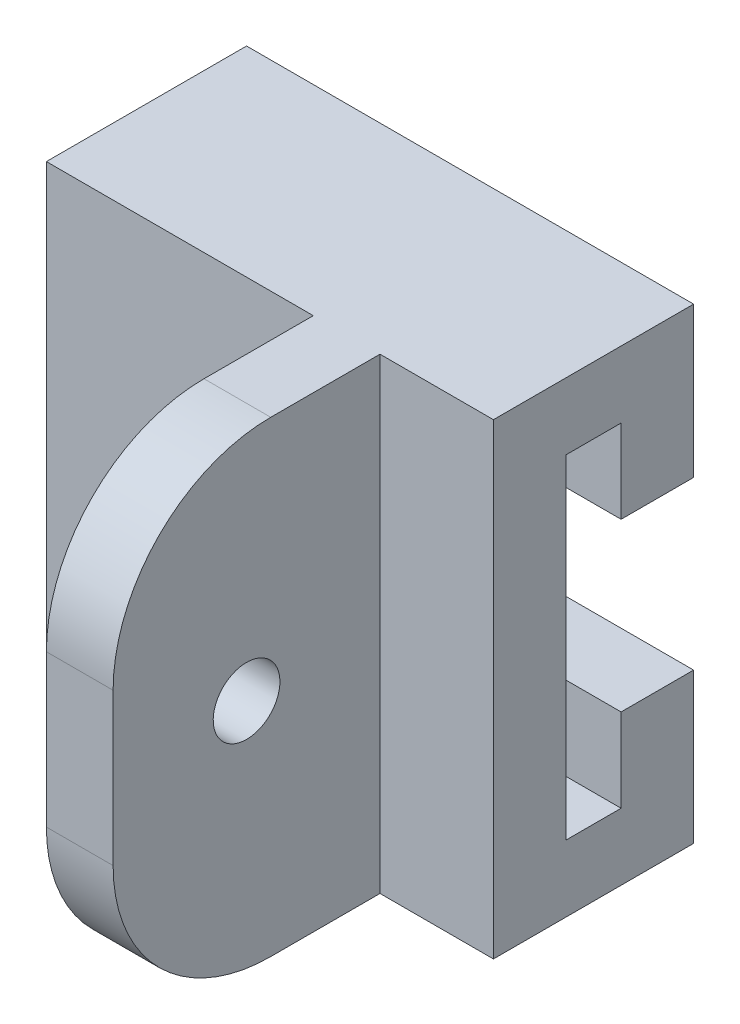
ISO-10303-21;
HEADER;
FILE_DESCRIPTION(('STEP AP214'),'2;1');
FILE_NAME('part.step','',(''),(''),'','','');
FILE_SCHEMA(('AUTOMOTIVE_DESIGN { 1 0 10303 214 1 1 1 1 }'));
ENDSEC;
DATA;
#1=APPLICATION_CONTEXT('core data for automotive mechanical design processes');
#2=APPLICATION_PROTOCOL_DEFINITION('international standard','automotive_design',2000,#1);
#3=PRODUCT_CONTEXT('',#1,'mechanical');
#4=PRODUCT('Part','Part','',(#3));
#5=PRODUCT_RELATED_PRODUCT_CATEGORY('part','',(#4));
#6=PRODUCT_DEFINITION_FORMATION('','',#4);
#7=PRODUCT_DEFINITION_CONTEXT('part definition',#1,'design');
#8=PRODUCT_DEFINITION('design','',#6,#7);
#9=PRODUCT_DEFINITION_SHAPE('','',#8);
#10=(LENGTH_UNIT() NAMED_UNIT(*) SI_UNIT(.MILLI.,.METRE.));
#11=(NAMED_UNIT(*) PLANE_ANGLE_UNIT() SI_UNIT($,.RADIAN.));
#12=(NAMED_UNIT(*) SI_UNIT($,.STERADIAN.) SOLID_ANGLE_UNIT());
#13=UNCERTAINTY_MEASURE_WITH_UNIT(LENGTH_MEASURE(1.E-05),#10,'distance_accuracy_value','');
#14=(GEOMETRIC_REPRESENTATION_CONTEXT(3) GLOBAL_UNCERTAINTY_ASSIGNED_CONTEXT((#13)) GLOBAL_UNIT_ASSIGNED_CONTEXT((#10,
#11,#12)) REPRESENTATION_CONTEXT('',''));
#15=CARTESIAN_POINT('',(0.,0.,0.));
#16=DIRECTION('',(0.,0.,1.));
#17=DIRECTION('',(1.,0.,0.));
#18=AXIS2_PLACEMENT_3D('',#15,#16,#17);
#19=CARTESIAN_POINT('',(0.,0.,19.05));
#20=DIRECTION('',(0.,0.,1.));
#21=DIRECTION('',(1.,0.,0.));
#22=AXIS2_PLACEMENT_3D('',#19,#20,#21);
#23=PLANE('',#22);
#24=DIRECTION('',(0.,1.,0.));
#25=VECTOR('',#24,1.);
#26=CARTESIAN_POINT('',(10.4775,22.225,19.05));
#27=LINE('',#26,#25);
#28=CARTESIAN_POINT('',(10.4775,-22.225,19.05));
#29=VERTEX_POINT('',#28);
#30=CARTESIAN_POINT('',(10.4775,22.225,19.05));
#31=VERTEX_POINT('',#30);
#32=EDGE_CURVE('E191',#29,#31,#27,.T.);
#33=ORIENTED_EDGE('',*,*,#32,.F.);
#34=DIRECTION('',(1.,0.,0.));
#35=VECTOR('',#34,1.);
#36=CARTESIAN_POINT('',(21.2725,-22.225,19.05));
#37=LINE('',#36,#35);
#38=CARTESIAN_POINT('',(21.2725,-22.225,19.05));
#39=VERTEX_POINT('',#38);
#40=EDGE_CURVE('E186',#29,#39,#37,.T.);
#41=ORIENTED_EDGE('',*,*,#40,.T.);
#42=DIRECTION('',(0.,1.,0.));
#43=VECTOR('',#42,1.);
#44=CARTESIAN_POINT('',(21.2725,-22.225,19.05));
#45=LINE('',#44,#43);
#46=CARTESIAN_POINT('',(21.2725,22.225,19.05));
#47=VERTEX_POINT('',#46);
#48=EDGE_CURVE('E185',#39,#47,#45,.T.);
#49=ORIENTED_EDGE('',*,*,#48,.T.);
#50=DIRECTION('',(-1.,0.,0.));
#51=VECTOR('',#50,1.);
#52=CARTESIAN_POINT('',(21.2725,22.225,19.05));
#53=LINE('',#52,#51);
#54=EDGE_CURVE('E274',#47,#31,#53,.T.);
#55=ORIENTED_EDGE('',*,*,#54,.T.);
#56=EDGE_LOOP('',(#33,#41,#49,#55));
#57=FACE_BOUND('',#56,.T.);
#58=ADVANCED_FACE('F41',(#57),#23,.T.);
#59=CARTESIAN_POINT('',(0.,0.,0.));
#60=DIRECTION('',(0.,0.,1.));
#61=DIRECTION('',(1.,0.,0.));
#62=AXIS2_PLACEMENT_3D('',#59,#60,#61);
#63=PLANE('',#62);
#64=DIRECTION('',(0.,1.,0.));
#65=VECTOR('',#64,1.);
#66=CARTESIAN_POINT('',(21.2725,-22.225,0.));
#67=LINE('',#66,#65);
#68=CARTESIAN_POINT('',(21.2725,7.9375,0.));
#69=VERTEX_POINT('',#68);
#70=CARTESIAN_POINT('',(21.2725,22.225,0.));
#71=VERTEX_POINT('',#70);
#72=EDGE_CURVE('E286',#69,#71,#67,.T.);
#73=ORIENTED_EDGE('',*,*,#72,.F.);
#74=DIRECTION('',(1.,0.,0.));
#75=VECTOR('',#74,1.);
#76=CARTESIAN_POINT('',(21.2725,7.9375,0.));
#77=LINE('',#76,#75);
#78=CARTESIAN_POINT('',(-21.2725,7.9375,0.));
#79=VERTEX_POINT('',#78);
#80=EDGE_CURVE('E214',#79,#69,#77,.T.);
#81=ORIENTED_EDGE('',*,*,#80,.F.);
#82=DIRECTION('',(0.,-1.,0.));
#83=VECTOR('',#82,1.);
#84=CARTESIAN_POINT('',(-21.2725,-22.225,0.));
#85=LINE('',#84,#83);
#86=CARTESIAN_POINT('',(-21.2725,22.225,0.));
#87=VERTEX_POINT('',#86);
#88=EDGE_CURVE('E279',#87,#79,#85,.T.);
#89=ORIENTED_EDGE('',*,*,#88,.F.);
#90=DIRECTION('',(-1.,0.,0.));
#91=VECTOR('',#90,1.);
#92=CARTESIAN_POINT('',(21.2725,22.225,0.));
#93=LINE('',#92,#91);
#94=EDGE_CURVE('E269',#71,#87,#93,.T.);
#95=ORIENTED_EDGE('',*,*,#94,.F.);
#96=EDGE_LOOP('',(#73,#81,#89,#95));
#97=FACE_BOUND('',#96,.T.);
#98=ADVANCED_FACE('F408',(#97),#63,.F.);
#99=CARTESIAN_POINT('',(21.2725,-15.875,6.9));
#100=DIRECTION('',(0.,0.,-1.));
#101=DIRECTION('',(-1.,0.,0.));
#102=AXIS2_PLACEMENT_3D('',#99,#100,#101);
#103=PLANE('',#102);
#104=DIRECTION('',(0.,-1.,0.));
#105=VECTOR('',#104,1.);
#106=CARTESIAN_POINT('',(-21.2725,-15.875,6.9));
#107=LINE('',#106,#105);
#108=CARTESIAN_POINT('',(-21.2725,15.875,6.9));
#109=VERTEX_POINT('',#108);
#110=CARTESIAN_POINT('',(-21.2725,7.9375,6.9));
#111=VERTEX_POINT('',#110);
#112=EDGE_CURVE('E255',#109,#111,#107,.T.);
#113=ORIENTED_EDGE('',*,*,#112,.T.);
#114=DIRECTION('',(-1.,0.,0.));
#115=VECTOR('',#114,1.);
#116=CARTESIAN_POINT('',(21.2725,7.9375,6.9));
#117=LINE('',#116,#115);
#118=CARTESIAN_POINT('',(21.2725,7.9375,6.9));
#119=VERTEX_POINT('',#118);
#120=EDGE_CURVE('E211',#119,#111,#117,.T.);
#121=ORIENTED_EDGE('',*,*,#120,.F.);
#122=DIRECTION('',(0.,-1.,0.));
#123=VECTOR('',#122,1.);
#124=CARTESIAN_POINT('',(21.2725,-15.875,6.9));
#125=LINE('',#124,#123);
#126=CARTESIAN_POINT('',(21.2725,15.875,6.9));
#127=VERTEX_POINT('',#126);
#128=EDGE_CURVE('E243',#127,#119,#125,.T.);
#129=ORIENTED_EDGE('',*,*,#128,.F.);
#130=DIRECTION('',(-1.,0.,0.));
#131=VECTOR('',#130,1.);
#132=CARTESIAN_POINT('',(21.2725,15.875,6.9));
#133=LINE('',#132,#131);
#134=EDGE_CURVE('E250',#127,#109,#133,.T.);
#135=ORIENTED_EDGE('',*,*,#134,.T.);
#136=EDGE_LOOP('',(#113,#121,#129,#135));
#137=FACE_BOUND('',#136,.T.);
#138=ADVANCED_FACE('F414',(#137),#103,.F.);
#139=CARTESIAN_POINT('',(-21.2725,-22.225,19.05));
#140=DIRECTION('',(1.,0.,0.));
#141=DIRECTION('',(0.,0.,-1.));
#142=AXIS2_PLACEMENT_3D('',#139,#140,#141);
#143=PLANE('',#142);
#144=DIRECTION('',(0.,0.,-1.));
#145=VECTOR('',#144,1.);
#146=CARTESIAN_POINT('',(-21.2725,15.875,6.9));
#147=LINE('',#146,#145);
#148=CARTESIAN_POINT('',(-21.2725,15.875,13.6500000000003));
#149=VERTEX_POINT('',#148);
#150=EDGE_CURVE('E236',#149,#109,#147,.T.);
#151=ORIENTED_EDGE('',*,*,#150,.F.);
#152=DIRECTION('',(0.,-1.,0.));
#153=VECTOR('',#152,1.);
#154=CARTESIAN_POINT('',(-21.2725,-22.225,13.6500000000003));
#155=LINE('',#154,#153);
#156=CARTESIAN_POINT('',(-21.2725,-15.875,13.6500000000003));
#157=VERTEX_POINT('',#156);
#158=EDGE_CURVE('E311',#149,#157,#155,.T.);
#159=ORIENTED_EDGE('',*,*,#158,.T.);
#160=DIRECTION('',(0.,0.,1.));
#161=VECTOR('',#160,1.);
#162=CARTESIAN_POINT('',(-21.2725,-15.875,6.9));
#163=LINE('',#162,#161);
#164=CARTESIAN_POINT('',(-21.2725,-15.875,6.9));
#165=VERTEX_POINT('',#164);
#166=EDGE_CURVE('E242',#165,#157,#163,.T.);
#167=ORIENTED_EDGE('',*,*,#166,.F.);
#168=CARTESIAN_POINT('',(-21.2725,-7.9375,6.9));
#169=VERTEX_POINT('',#168);
#170=EDGE_CURVE('E254',#169,#165,#107,.T.);
#171=ORIENTED_EDGE('',*,*,#170,.F.);
#172=DIRECTION('',(0.,0.,-1.));
#173=VECTOR('',#172,1.);
#174=CARTESIAN_POINT('',(-21.2725,-7.9375,19.051));
#175=LINE('',#174,#173);
#176=CARTESIAN_POINT('',(-21.2725,-7.9375,0.));
#177=VERTEX_POINT('',#176);
#178=EDGE_CURVE('E223',#169,#177,#175,.T.);
#179=ORIENTED_EDGE('',*,*,#178,.T.);
#180=CARTESIAN_POINT('',(-21.2725,-22.225,0.));
#181=VERTEX_POINT('',#180);
#182=EDGE_CURVE('E265',#177,#181,#85,.T.);
#183=ORIENTED_EDGE('',*,*,#182,.T.);
#184=DIRECTION('',(0.,0.,-1.));
#185=VECTOR('',#184,1.);
#186=CARTESIAN_POINT('',(-21.2725,-22.225,19.05));
#187=LINE('',#186,#185);
#188=CARTESIAN_POINT('',(-21.2725,-22.225,19.05));
#189=VERTEX_POINT('',#188);
#190=EDGE_CURVE('E304',#189,#181,#187,.T.);
#191=ORIENTED_EDGE('',*,*,#190,.F.);
#192=DIRECTION('',(0.,-1.,0.));
#193=VECTOR('',#192,1.);
#194=CARTESIAN_POINT('',(-21.2725,-22.225,19.05));
#195=LINE('',#194,#193);
#196=CARTESIAN_POINT('',(-21.2725,22.225,19.05));
#197=VERTEX_POINT('',#196);
#198=EDGE_CURVE('E182',#197,#189,#195,.T.);
#199=ORIENTED_EDGE('',*,*,#198,.F.);
#200=DIRECTION('',(0.,0.,-1.));
#201=VECTOR('',#200,1.);
#202=CARTESIAN_POINT('',(-21.2725,22.225,19.05));
#203=LINE('',#202,#201);
#204=EDGE_CURVE('E278',#197,#87,#203,.T.);
#205=ORIENTED_EDGE('',*,*,#204,.T.);
#206=ORIENTED_EDGE('',*,*,#88,.T.);
#207=DIRECTION('',(0.,0.,-1.));
#208=VECTOR('',#207,1.);
#209=CARTESIAN_POINT('',(-21.2725,7.9375,19.051));
#210=LINE('',#209,#208);
#211=EDGE_CURVE('E227',#111,#79,#210,.T.);
#212=ORIENTED_EDGE('',*,*,#211,.F.);
#213=ORIENTED_EDGE('',*,*,#112,.F.);
#214=EDGE_LOOP('',(#151,#159,#167,#171,#179,#183,#191,#199,#205,#206,#212,#213));
#215=FACE_BOUND('',#214,.T.);
#216=ADVANCED_FACE('F374',(#215),#143,.F.);
#217=CARTESIAN_POINT('',(21.2725,-22.225,19.05));
#218=DIRECTION('',(0.,1.,0.));
#219=DIRECTION('',(-1.,0.,0.));
#220=AXIS2_PLACEMENT_3D('',#217,#218,#219);
#221=PLANE('',#220);
#222=DIRECTION('',(0.,0.,-1.));
#223=VECTOR('',#222,1.);
#224=CARTESIAN_POINT('',(10.4775,-22.225,44.45));
#225=LINE('',#224,#223);
#226=CARTESIAN_POINT('',(10.4775,-22.225,29.45));
#227=VERTEX_POINT('',#226);
#228=EDGE_CURVE('E174',#227,#29,#225,.T.);
#229=ORIENTED_EDGE('',*,*,#228,.F.);
#230=DIRECTION('',(1.,0.,0.));
#231=VECTOR('',#230,1.);
#232=CARTESIAN_POINT('',(21.2725,-22.225,29.45));
#233=LINE('',#232,#231);
#234=CARTESIAN_POINT('',(4.1275,-22.225,29.45));
#235=VERTEX_POINT('',#234);
#236=EDGE_CURVE('E65',#227,#235,#233,.F.);
#237=ORIENTED_EDGE('',*,*,#236,.T.);
#238=DIRECTION('',(0.,0.,-1.));
#239=VECTOR('',#238,1.);
#240=CARTESIAN_POINT('',(4.1275,-22.225,44.45));
#241=LINE('',#240,#239);
#242=CARTESIAN_POINT('',(4.1275,-22.225,19.05));
#243=VERTEX_POINT('',#242);
#244=EDGE_CURVE('E164',#235,#243,#241,.T.);
#245=ORIENTED_EDGE('',*,*,#244,.T.);
#246=EDGE_CURVE('E168',#189,#243,#37,.T.);
#247=ORIENTED_EDGE('',*,*,#246,.F.);
#248=ORIENTED_EDGE('',*,*,#190,.T.);
#249=DIRECTION('',(1.,0.,0.));
#250=VECTOR('',#249,1.);
#251=CARTESIAN_POINT('',(21.2725,-22.225,0.));
#252=LINE('',#251,#250);
#253=CARTESIAN_POINT('',(21.2725,-22.225,0.));
#254=VERTEX_POINT('',#253);
#255=EDGE_CURVE('E283',#181,#254,#252,.T.);
#256=ORIENTED_EDGE('',*,*,#255,.T.);
#257=DIRECTION('',(0.,0.,-1.));
#258=VECTOR('',#257,1.);
#259=CARTESIAN_POINT('',(21.2725,-22.225,19.05));
#260=LINE('',#259,#258);
#261=EDGE_CURVE('E300',#39,#254,#260,.T.);
#262=ORIENTED_EDGE('',*,*,#261,.F.);
#263=ORIENTED_EDGE('',*,*,#40,.F.);
#264=EDGE_LOOP('',(#229,#237,#245,#247,#248,#256,#262,#263));
#265=FACE_BOUND('',#264,.T.);
#266=ADVANCED_FACE('F166',(#265),#221,.F.);
#267=CARTESIAN_POINT('',(21.2725,-22.225,19.05));
#268=DIRECTION('',(-1.,0.,0.));
#269=DIRECTION('',(0.,0.,1.));
#270=AXIS2_PLACEMENT_3D('',#267,#268,#269);
#271=PLANE('',#270);
#272=DIRECTION('',(0.,-1.,0.));
#273=VECTOR('',#272,1.);
#274=CARTESIAN_POINT('',(21.2725,-15.875,12.164295861974));
#275=LINE('',#274,#273);
#276=CARTESIAN_POINT('',(21.2725,-15.875,12.164295861974));
#277=VERTEX_POINT('',#276);
#278=CARTESIAN_POINT('',(21.2725,15.875,12.164295861974));
#279=VERTEX_POINT('',#278);
#280=EDGE_CURVE('E307',#277,#279,#275,.F.);
#281=ORIENTED_EDGE('',*,*,#280,.T.);
#282=DIRECTION('',(0.,0.,-1.));
#283=VECTOR('',#282,1.);
#284=CARTESIAN_POINT('',(21.2725,15.875,6.9));
#285=LINE('',#284,#283);
#286=EDGE_CURVE('E237',#279,#127,#285,.T.);
#287=ORIENTED_EDGE('',*,*,#286,.T.);
#288=ORIENTED_EDGE('',*,*,#128,.T.);
#289=DIRECTION('',(0.,0.,-1.));
#290=VECTOR('',#289,1.);
#291=CARTESIAN_POINT('',(21.2725,7.9375,19.051));
#292=LINE('',#291,#290);
#293=EDGE_CURVE('E218',#119,#69,#292,.T.);
#294=ORIENTED_EDGE('',*,*,#293,.T.);
#295=ORIENTED_EDGE('',*,*,#72,.T.);
#296=DIRECTION('',(0.,0.,-1.));
#297=VECTOR('',#296,1.);
#298=CARTESIAN_POINT('',(21.2725,22.225,19.05));
#299=LINE('',#298,#297);
#300=EDGE_CURVE('E296',#47,#71,#299,.T.);
#301=ORIENTED_EDGE('',*,*,#300,.F.);
#302=ORIENTED_EDGE('',*,*,#48,.F.);
#303=ORIENTED_EDGE('',*,*,#261,.T.);
#304=CARTESIAN_POINT('',(21.2725,-7.9375,0.));
#305=VERTEX_POINT('',#304);
#306=EDGE_CURVE('E287',#254,#305,#67,.T.);
#307=ORIENTED_EDGE('',*,*,#306,.T.);
#308=DIRECTION('',(0.,0.,-1.));
#309=VECTOR('',#308,1.);
#310=CARTESIAN_POINT('',(21.2725,-7.9375,19.051));
#311=LINE('',#310,#309);
#312=CARTESIAN_POINT('',(21.2725,-7.9375,6.9));
#313=VERTEX_POINT('',#312);
#314=EDGE_CURVE('E228',#313,#305,#311,.T.);
#315=ORIENTED_EDGE('',*,*,#314,.F.);
#316=CARTESIAN_POINT('',(21.2725,-15.875,6.9));
#317=VERTEX_POINT('',#316);
#318=EDGE_CURVE('E241',#313,#317,#125,.T.);
#319=ORIENTED_EDGE('',*,*,#318,.T.);
#320=DIRECTION('',(0.,0.,1.));
#321=VECTOR('',#320,1.);
#322=CARTESIAN_POINT('',(21.2725,-15.875,6.9));
#323=LINE('',#322,#321);
#324=EDGE_CURVE('E247',#317,#277,#323,.T.);
#325=ORIENTED_EDGE('',*,*,#324,.T.);
#326=EDGE_LOOP('',(#281,#287,#288,#294,#295,#301,#302,#303,#307,#315,#319,#325));
#327=FACE_BOUND('',#326,.T.);
#328=ADVANCED_FACE('F382',(#327),#271,.F.);
#329=CARTESIAN_POINT('',(21.2725,22.225,19.05));
#330=DIRECTION('',(0.,-1.,0.));
#331=DIRECTION('',(1.,0.,0.));
#332=AXIS2_PLACEMENT_3D('',#329,#330,#331);
#333=PLANE('',#332);
#334=DIRECTION('',(0.,0.,-1.));
#335=VECTOR('',#334,1.);
#336=CARTESIAN_POINT('',(4.12749999999999,22.225,44.45));
#337=LINE('',#336,#335);
#338=CARTESIAN_POINT('',(4.12749999999999,22.225,29.45));
#339=VERTEX_POINT('',#338);
#340=CARTESIAN_POINT('',(4.12749999999999,22.225,19.05));
#341=VERTEX_POINT('',#340);
#342=EDGE_CURVE('E173',#339,#341,#337,.T.);
#343=ORIENTED_EDGE('',*,*,#342,.F.);
#344=DIRECTION('',(-1.,0.,0.));
#345=VECTOR('',#344,1.);
#346=CARTESIAN_POINT('',(21.2725,22.225,29.45));
#347=LINE('',#346,#345);
#348=CARTESIAN_POINT('',(10.4775,22.225,29.45));
#349=VERTEX_POINT('',#348);
#350=EDGE_CURVE('E11',#339,#349,#347,.F.);
#351=ORIENTED_EDGE('',*,*,#350,.T.);
#352=DIRECTION('',(0.,0.,-1.));
#353=VECTOR('',#352,1.);
#354=CARTESIAN_POINT('',(10.4775,22.225,44.45));
#355=LINE('',#354,#353);
#356=EDGE_CURVE('E207',#349,#31,#355,.T.);
#357=ORIENTED_EDGE('',*,*,#356,.T.);
#358=ORIENTED_EDGE('',*,*,#54,.F.);
#359=ORIENTED_EDGE('',*,*,#300,.T.);
#360=ORIENTED_EDGE('',*,*,#94,.T.);
#361=ORIENTED_EDGE('',*,*,#204,.F.);
#362=EDGE_CURVE('E273',#341,#197,#53,.T.);
#363=ORIENTED_EDGE('',*,*,#362,.F.);
#364=EDGE_LOOP('',(#343,#351,#357,#358,#359,#360,#361,#363));
#365=FACE_BOUND('',#364,.T.);
#366=ADVANCED_FACE('F399',(#365),#333,.F.);
#367=DIRECTION('',(0.,-1.,0.));
#368=VECTOR('',#367,1.);
#369=CARTESIAN_POINT('',(4.12749999999999,22.225,19.05));
#370=LINE('',#369,#368);
#371=EDGE_CURVE('E179',#341,#243,#370,.T.);
#372=ORIENTED_EDGE('',*,*,#371,.F.);
#373=ORIENTED_EDGE('',*,*,#362,.T.);
#374=ORIENTED_EDGE('',*,*,#198,.T.);
#375=ORIENTED_EDGE('',*,*,#246,.T.);
#376=EDGE_LOOP('',(#372,#373,#374,#375));
#377=FACE_BOUND('',#376,.T.);
#378=ADVANCED_FACE('F178',(#377),#23,.T.);
#379=ORIENTED_EDGE('',*,*,#182,.F.);
#380=DIRECTION('',(-1.,0.,0.));
#381=VECTOR('',#380,1.);
#382=CARTESIAN_POINT('',(21.2725,-7.9375,0.));
#383=LINE('',#382,#381);
#384=EDGE_CURVE('E215',#305,#177,#383,.T.);
#385=ORIENTED_EDGE('',*,*,#384,.F.);
#386=ORIENTED_EDGE('',*,*,#306,.F.);
#387=ORIENTED_EDGE('',*,*,#255,.F.);
#388=EDGE_LOOP('',(#379,#385,#386,#387));
#389=FACE_BOUND('',#388,.T.);
#390=ADVANCED_FACE('F390',(#389),#63,.F.);
#391=CARTESIAN_POINT('',(21.2725,-15.875,6.9));
#392=DIRECTION('',(0.,-1.,0.));
#393=DIRECTION('',(0.,0.,-1.));
#394=AXIS2_PLACEMENT_3D('',#391,#392,#393);
#395=PLANE('',#394);
#396=ORIENTED_EDGE('',*,*,#166,.T.);
#397=DIRECTION('',(-0.999390827019096,0.,0.0348994967024975));
#398=VECTOR('',#397,1.);
#399=CARTESIAN_POINT('',(21.4561093580385,-15.875,12.1578840819055));
#400=LINE('',#399,#398);
#401=EDGE_CURVE('E319',#157,#277,#400,.F.);
#402=ORIENTED_EDGE('',*,*,#401,.T.);
#403=ORIENTED_EDGE('',*,*,#324,.F.);
#404=DIRECTION('',(-1.,0.,0.));
#405=VECTOR('',#404,1.);
#406=CARTESIAN_POINT('',(21.2725,-15.875,6.9));
#407=LINE('',#406,#405);
#408=EDGE_CURVE('E261',#317,#165,#407,.T.);
#409=ORIENTED_EDGE('',*,*,#408,.T.);
#410=EDGE_LOOP('',(#396,#402,#403,#409));
#411=FACE_BOUND('',#410,.T.);
#412=ADVANCED_FACE('F372',(#411),#395,.F.);
#413=ORIENTED_EDGE('',*,*,#318,.F.);
#414=DIRECTION('',(1.,0.,0.));
#415=VECTOR('',#414,1.);
#416=CARTESIAN_POINT('',(21.2725,-7.9375,6.9));
#417=LINE('',#416,#415);
#418=EDGE_CURVE('E210',#169,#313,#417,.T.);
#419=ORIENTED_EDGE('',*,*,#418,.F.);
#420=ORIENTED_EDGE('',*,*,#170,.T.);
#421=ORIENTED_EDGE('',*,*,#408,.F.);
#422=EDGE_LOOP('',(#413,#419,#420,#421));
#423=FACE_BOUND('',#422,.T.);
#424=ADVANCED_FACE('F367',(#423),#103,.F.);
#425=CARTESIAN_POINT('',(21.2725,15.875,6.9));
#426=DIRECTION('',(0.,1.,0.));
#427=DIRECTION('',(0.,0.,1.));
#428=AXIS2_PLACEMENT_3D('',#425,#426,#427);
#429=PLANE('',#428);
#430=ORIENTED_EDGE('',*,*,#150,.T.);
#431=ORIENTED_EDGE('',*,*,#134,.F.);
#432=ORIENTED_EDGE('',*,*,#286,.F.);
#433=DIRECTION('',(0.999390827019096,0.,-0.0348994967024975));
#434=VECTOR('',#433,1.);
#435=CARTESIAN_POINT('',(21.4561093580385,15.875,12.1578840819055));
#436=LINE('',#435,#434);
#437=EDGE_CURVE('E315',#279,#149,#436,.F.);
#438=ORIENTED_EDGE('',*,*,#437,.T.);
#439=EDGE_LOOP('',(#430,#431,#432,#438));
#440=FACE_BOUND('',#439,.T.);
#441=ADVANCED_FACE('F416',(#440),#429,.F.);
#442=CARTESIAN_POINT('',(21.2725,-7.9375,19.051));
#443=DIRECTION('',(0.,-1.,0.));
#444=DIRECTION('',(0.,0.,-1.));
#445=AXIS2_PLACEMENT_3D('',#442,#443,#444);
#446=PLANE('',#445);
#447=ORIENTED_EDGE('',*,*,#418,.T.);
#448=ORIENTED_EDGE('',*,*,#314,.T.);
#449=ORIENTED_EDGE('',*,*,#384,.T.);
#450=ORIENTED_EDGE('',*,*,#178,.F.);
#451=EDGE_LOOP('',(#447,#448,#449,#450));
#452=FACE_BOUND('',#451,.T.);
#453=ADVANCED_FACE('F387',(#452),#446,.F.);
#454=CARTESIAN_POINT('',(21.2725,7.9375,19.051));
#455=DIRECTION('',(0.,1.,0.));
#456=DIRECTION('',(0.,0.,1.));
#457=AXIS2_PLACEMENT_3D('',#454,#455,#456);
#458=PLANE('',#457);
#459=ORIENTED_EDGE('',*,*,#120,.T.);
#460=ORIENTED_EDGE('',*,*,#211,.T.);
#461=ORIENTED_EDGE('',*,*,#80,.T.);
#462=ORIENTED_EDGE('',*,*,#293,.F.);
#463=EDGE_LOOP('',(#459,#460,#461,#462));
#464=FACE_BOUND('',#463,.T.);
#465=ADVANCED_FACE('F410',(#464),#458,.F.);
#466=CARTESIAN_POINT('',(21.6818799243863,-15.875,12.15));
#467=DIRECTION('',(0.0348994967024975,0.,0.999390827019096));
#468=DIRECTION('',(0.,1.,0.));
#469=AXIS2_PLACEMENT_3D('',#466,#467,#468);
#470=PLANE('',#469);
#471=ORIENTED_EDGE('',*,*,#401,.F.);
#472=ORIENTED_EDGE('',*,*,#158,.F.);
#473=ORIENTED_EDGE('',*,*,#437,.F.);
#474=ORIENTED_EDGE('',*,*,#280,.F.);
#475=EDGE_LOOP('',(#471,#472,#473,#474));
#476=FACE_BOUND('',#475,.T.);
#477=ADVANCED_FACE('F379',(#476),#470,.F.);
#478=CARTESIAN_POINT('',(10.4775,22.225,44.45));
#479=DIRECTION('',(-1.,0.,0.));
#480=DIRECTION('',(0.,-1.,0.));
#481=AXIS2_PLACEMENT_3D('',#478,#479,#480);
#482=PLANE('',#481);
#483=CARTESIAN_POINT('',(10.4775,0.,31.75));
#484=DIRECTION('',(-1.,0.,0.));
#485=DIRECTION('',(0.,-1.,0.));
#486=AXIS2_PLACEMENT_3D('',#483,#484,#485);
#487=CIRCLE('',#486,3.175);
#488=CARTESIAN_POINT('',(10.4775,-3.175,31.75));
#489=VERTEX_POINT('',#488);
#490=EDGE_CURVE('E199',#489,#489,#487,.T.);
#491=ORIENTED_EDGE('',*,*,#490,.T.);
#492=EDGE_LOOP('',(#491));
#493=FACE_BOUND('',#492,.T.);
#494=DIRECTION('',(0.,1.,0.));
#495=VECTOR('',#494,1.);
#496=CARTESIAN_POINT('',(10.4775,22.225,44.45));
#497=LINE('',#496,#495);
#498=CARTESIAN_POINT('',(10.4775,-7.225,44.45));
#499=VERTEX_POINT('',#498);
#500=CARTESIAN_POINT('',(10.4775,7.225,44.45));
#501=VERTEX_POINT('',#500);
#502=EDGE_CURVE('E190',#499,#501,#497,.T.);
#503=ORIENTED_EDGE('',*,*,#502,.F.);
#504=CARTESIAN_POINT('',(10.4775,-7.225,29.45));
#505=DIRECTION('',(-1.,0.,0.));
#506=DIRECTION('',(0.,-1.,0.));
#507=AXIS2_PLACEMENT_3D('',#504,#505,#506);
#508=CIRCLE('',#507,15.);
#509=EDGE_CURVE('E334',#499,#227,#508,.F.);
#510=ORIENTED_EDGE('',*,*,#509,.T.);
#511=ORIENTED_EDGE('',*,*,#228,.T.);
#512=ORIENTED_EDGE('',*,*,#32,.T.);
#513=ORIENTED_EDGE('',*,*,#356,.F.);
#514=CARTESIAN_POINT('',(10.4775,7.225,29.45));
#515=DIRECTION('',(-1.,0.,0.));
#516=DIRECTION('',(0.,-1.,0.));
#517=AXIS2_PLACEMENT_3D('',#514,#515,#516);
#518=CIRCLE('',#517,15.);
#519=EDGE_CURVE('E331',#349,#501,#518,.F.);
#520=ORIENTED_EDGE('',*,*,#519,.T.);
#521=EDGE_LOOP('',(#503,#510,#511,#512,#513,#520));
#522=FACE_BOUND('',#521,.T.);
#523=ADVANCED_FACE('F351',(#493,#522),#482,.F.);
#524=CARTESIAN_POINT('',(4.12749999999999,22.225,44.45));
#525=DIRECTION('',(1.,0.,0.));
#526=DIRECTION('',(0.,1.,0.));
#527=AXIS2_PLACEMENT_3D('',#524,#525,#526);
#528=PLANE('',#527);
#529=CARTESIAN_POINT('',(4.12749999999999,0.,31.75));
#530=DIRECTION('',(-1.,0.,0.));
#531=DIRECTION('',(0.,-1.,0.));
#532=AXIS2_PLACEMENT_3D('',#529,#530,#531);
#533=CIRCLE('',#532,3.175);
#534=CARTESIAN_POINT('',(4.12749999999999,-3.175,31.75));
#535=VERTEX_POINT('',#534);
#536=EDGE_CURVE('E598',#535,#535,#533,.T.);
#537=ORIENTED_EDGE('',*,*,#536,.F.);
#538=EDGE_LOOP('',(#537));
#539=FACE_BOUND('',#538,.T.);
#540=ORIENTED_EDGE('',*,*,#244,.F.);
#541=CARTESIAN_POINT('',(4.12749999999999,-7.225,29.45));
#542=DIRECTION('',(1.,0.,0.));
#543=DIRECTION('',(0.,1.,0.));
#544=AXIS2_PLACEMENT_3D('',#541,#542,#543);
#545=CIRCLE('',#544,15.);
#546=CARTESIAN_POINT('',(4.12749999999999,-7.225,44.45));
#547=VERTEX_POINT('',#546);
#548=EDGE_CURVE('E50',#235,#547,#545,.F.);
#549=ORIENTED_EDGE('',*,*,#548,.T.);
#550=DIRECTION('',(0.,-1.,0.));
#551=VECTOR('',#550,1.);
#552=CARTESIAN_POINT('',(4.12749999999999,22.225,44.45));
#553=LINE('',#552,#551);
#554=CARTESIAN_POINT('',(4.12749999999999,7.225,44.45));
#555=VERTEX_POINT('',#554);
#556=EDGE_CURVE('E196',#555,#547,#553,.T.);
#557=ORIENTED_EDGE('',*,*,#556,.F.);
#558=CARTESIAN_POINT('',(4.12749999999999,7.225,29.45));
#559=DIRECTION('',(1.,0.,0.));
#560=DIRECTION('',(0.,1.,0.));
#561=AXIS2_PLACEMENT_3D('',#558,#559,#560);
#562=CIRCLE('',#561,15.);
#563=EDGE_CURVE('E57',#555,#339,#562,.F.);
#564=ORIENTED_EDGE('',*,*,#563,.T.);
#565=ORIENTED_EDGE('',*,*,#342,.T.);
#566=ORIENTED_EDGE('',*,*,#371,.T.);
#567=EDGE_LOOP('',(#540,#549,#557,#564,#565,#566));
#568=FACE_BOUND('',#567,.T.);
#569=ADVANCED_FACE('F188',(#539,#568),#528,.F.);
#570=CARTESIAN_POINT('',(0.,0.,44.45));
#571=DIRECTION('',(0.,0.,-1.));
#572=DIRECTION('',(-1.,0.,0.));
#573=AXIS2_PLACEMENT_3D('',#570,#571,#572);
#574=PLANE('',#573);
#575=ORIENTED_EDGE('',*,*,#556,.T.);
#576=DIRECTION('',(1.,0.,0.));
#577=VECTOR('',#576,1.);
#578=CARTESIAN_POINT('',(0.,-7.225,44.45));
#579=LINE('',#578,#577);
#580=EDGE_CURVE('E327',#547,#499,#579,.T.);
#581=ORIENTED_EDGE('',*,*,#580,.T.);
#582=ORIENTED_EDGE('',*,*,#502,.T.);
#583=DIRECTION('',(-1.,0.,0.));
#584=VECTOR('',#583,1.);
#585=CARTESIAN_POINT('',(0.,7.225,44.45));
#586=LINE('',#585,#584);
#587=EDGE_CURVE('E323',#501,#555,#586,.T.);
#588=ORIENTED_EDGE('',*,*,#587,.T.);
#589=EDGE_LOOP('',(#575,#581,#582,#588));
#590=FACE_BOUND('',#589,.T.);
#591=ADVANCED_FACE('F345',(#590),#574,.F.);
#592=CARTESIAN_POINT('',(29.5275,0.,31.75));
#593=DIRECTION('',(-1.,0.,0.));
#594=DIRECTION('',(0.,-1.,0.));
#595=AXIS2_PLACEMENT_3D('',#592,#593,#594);
#596=CYLINDRICAL_SURFACE('',#595,3.175);
#597=ORIENTED_EDGE('',*,*,#536,.T.);
#598=EDGE_LOOP('',(#597));
#599=FACE_BOUND('',#598,.T.);
#600=ORIENTED_EDGE('',*,*,#490,.F.);
#601=EDGE_LOOP('',(#600));
#602=FACE_BOUND('',#601,.T.);
#603=ADVANCED_FACE('F451',(#599,#602),#596,.F.);
#604=CARTESIAN_POINT('',(0.,-7.225,29.45));
#605=DIRECTION('',(1.,0.,0.));
#606=DIRECTION('',(0.,1.,0.));
#607=AXIS2_PLACEMENT_3D('',#604,#605,#606);
#608=CYLINDRICAL_SURFACE('',#607,15.);
#609=ORIENTED_EDGE('',*,*,#548,.F.);
#610=ORIENTED_EDGE('',*,*,#236,.F.);
#611=ORIENTED_EDGE('',*,*,#509,.F.);
#612=ORIENTED_EDGE('',*,*,#580,.F.);
#613=EDGE_LOOP('',(#609,#610,#611,#612));
#614=FACE_BOUND('',#613,.T.);
#615=ADVANCED_FACE('F349',(#614),#608,.T.);
#616=CARTESIAN_POINT('',(0.,7.225,29.45));
#617=DIRECTION('',(-1.,0.,0.));
#618=DIRECTION('',(0.,-1.,0.));
#619=AXIS2_PLACEMENT_3D('',#616,#617,#618);
#620=CYLINDRICAL_SURFACE('',#619,15.);
#621=ORIENTED_EDGE('',*,*,#519,.F.);
#622=ORIENTED_EDGE('',*,*,#350,.F.);
#623=ORIENTED_EDGE('',*,*,#563,.F.);
#624=ORIENTED_EDGE('',*,*,#587,.F.);
#625=EDGE_LOOP('',(#621,#622,#623,#624));
#626=FACE_BOUND('',#625,.T.);
#627=ADVANCED_FACE('F43',(#626),#620,.T.);
#628=CLOSED_SHELL('',(#58,#98,#138,#216,#266,#328,#366,#378,#390,#412,#424,#441,#453,#465,#477,
#523,#569,#591,#603,#615,#627));
#629=MANIFOLD_SOLID_BREP('B2',#628);
#630=ADVANCED_BREP_SHAPE_REPRESENTATION('',(#18,#629),#14);
#631=SHAPE_DEFINITION_REPRESENTATION(#9,#630);
ENDSEC;
END-ISO-10303-21;
